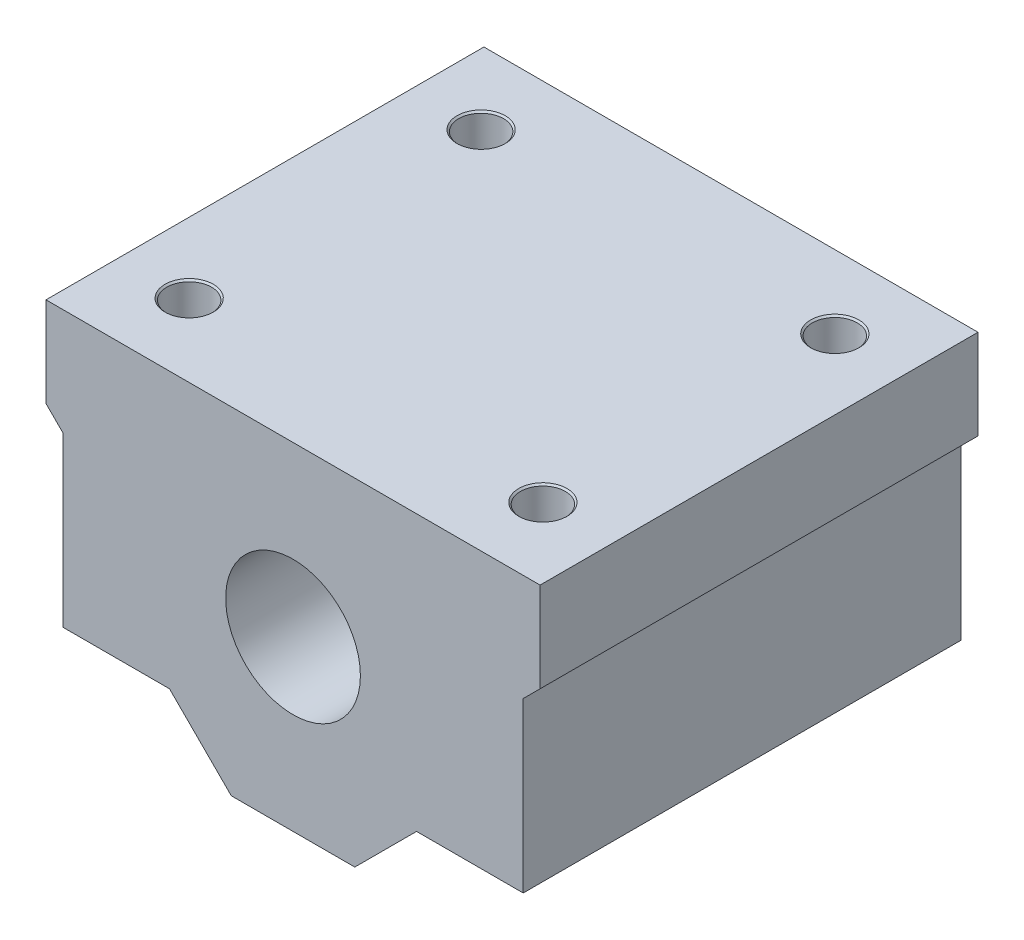
ISO-10303-21;
HEADER;
FILE_DESCRIPTION(('STEP AP214'),'2;1');
FILE_NAME('part.step','',(''),(''),'','','');
FILE_SCHEMA(('AUTOMOTIVE_DESIGN { 1 0 10303 214 1 1 1 1 }'));
ENDSEC;
DATA;
#1=APPLICATION_CONTEXT('core data for automotive mechanical design processes');
#2=APPLICATION_PROTOCOL_DEFINITION('international standard','automotive_design',2000,#1);
#3=PRODUCT_CONTEXT('',#1,'mechanical');
#4=PRODUCT('Part','Part','',(#3));
#5=PRODUCT_RELATED_PRODUCT_CATEGORY('part','',(#4));
#6=PRODUCT_DEFINITION_FORMATION('','',#4);
#7=PRODUCT_DEFINITION_CONTEXT('part definition',#1,'design');
#8=PRODUCT_DEFINITION('design','',#6,#7);
#9=PRODUCT_DEFINITION_SHAPE('','',#8);
#10=(LENGTH_UNIT() NAMED_UNIT(*) SI_UNIT(.MILLI.,.METRE.));
#11=(NAMED_UNIT(*) PLANE_ANGLE_UNIT() SI_UNIT($,.RADIAN.));
#12=(NAMED_UNIT(*) SI_UNIT($,.STERADIAN.) SOLID_ANGLE_UNIT());
#13=UNCERTAINTY_MEASURE_WITH_UNIT(LENGTH_MEASURE(1.E-05),#10,'distance_accuracy_value','');
#14=(GEOMETRIC_REPRESENTATION_CONTEXT(3) GLOBAL_UNCERTAINTY_ASSIGNED_CONTEXT((#13)) GLOBAL_UNIT_ASSIGNED_CONTEXT((#10,
#11,#12)) REPRESENTATION_CONTEXT('',''));
#15=CARTESIAN_POINT('',(0.,0.,0.));
#16=DIRECTION('',(0.,0.,1.));
#17=DIRECTION('',(1.,0.,0.));
#18=AXIS2_PLACEMENT_3D('',#15,#16,#17);
#19=CARTESIAN_POINT('',(0.,0.,39.));
#20=DIRECTION('',(0.,0.,1.));
#21=DIRECTION('',(1.,0.,0.));
#22=AXIS2_PLACEMENT_3D('',#19,#20,#21);
#23=PLANE('',#22);
#24=DIRECTION('',(0.,-1.,0.));
#25=VECTOR('',#24,1.);
#26=CARTESIAN_POINT('',(-22.,15.,39.));
#27=LINE('',#26,#25);
#28=CARTESIAN_POINT('',(-22.,15.,39.));
#29=VERTEX_POINT('',#28);
#30=CARTESIAN_POINT('',(-22.,7.,39.));
#31=VERTEX_POINT('',#30);
#32=EDGE_CURVE('E178',#29,#31,#27,.T.);
#33=ORIENTED_EDGE('',*,*,#32,.T.);
#34=DIRECTION('',(0.707106781186549,-0.707106781186546,0.));
#35=VECTOR('',#34,1.);
#36=CARTESIAN_POINT('',(-22.,7.,39.));
#37=LINE('',#36,#35);
#38=CARTESIAN_POINT('',(-20.5,5.5,39.));
#39=VERTEX_POINT('',#38);
#40=EDGE_CURVE('E106',#31,#39,#37,.T.);
#41=ORIENTED_EDGE('',*,*,#40,.T.);
#42=DIRECTION('',(0.,-1.,0.));
#43=VECTOR('',#42,1.);
#44=CARTESIAN_POINT('',(-20.5,5.5,39.));
#45=LINE('',#44,#43);
#46=CARTESIAN_POINT('',(-20.5,-9.5,39.));
#47=VERTEX_POINT('',#46);
#48=EDGE_CURVE('E338',#39,#47,#45,.T.);
#49=ORIENTED_EDGE('',*,*,#48,.T.);
#50=DIRECTION('',(1.,0.,0.));
#51=VECTOR('',#50,1.);
#52=CARTESIAN_POINT('',(-20.5,-9.5,39.));
#53=LINE('',#52,#51);
#54=CARTESIAN_POINT('',(-11.,-9.5,39.));
#55=VERTEX_POINT('',#54);
#56=EDGE_CURVE('E340',#47,#55,#53,.T.);
#57=ORIENTED_EDGE('',*,*,#56,.T.);
#58=DIRECTION('',(0.707106781186546,-0.707106781186549,0.));
#59=VECTOR('',#58,1.);
#60=CARTESIAN_POINT('',(-11.,-9.5,39.));
#61=LINE('',#60,#59);
#62=CARTESIAN_POINT('',(-5.50000000000002,-15.,39.));
#63=VERTEX_POINT('',#62);
#64=EDGE_CURVE('E342',#55,#63,#61,.T.);
#65=ORIENTED_EDGE('',*,*,#64,.T.);
#66=DIRECTION('',(1.,0.,0.));
#67=VECTOR('',#66,1.);
#68=CARTESIAN_POINT('',(-5.50000000000002,-15.,39.));
#69=LINE('',#68,#67);
#70=CARTESIAN_POINT('',(5.50000000000002,-15.,39.));
#71=VERTEX_POINT('',#70);
#72=EDGE_CURVE('E344',#63,#71,#69,.T.);
#73=ORIENTED_EDGE('',*,*,#72,.T.);
#74=DIRECTION('',(0.707106781186546,0.707106781186549,0.));
#75=VECTOR('',#74,1.);
#76=CARTESIAN_POINT('',(11.,-9.5,39.));
#77=LINE('',#76,#75);
#78=CARTESIAN_POINT('',(11.,-9.5,39.));
#79=VERTEX_POINT('',#78);
#80=EDGE_CURVE('E346',#71,#79,#77,.T.);
#81=ORIENTED_EDGE('',*,*,#80,.T.);
#82=DIRECTION('',(1.,0.,0.));
#83=VECTOR('',#82,1.);
#84=CARTESIAN_POINT('',(20.5,-9.5,39.));
#85=LINE('',#84,#83);
#86=CARTESIAN_POINT('',(20.5,-9.5,39.));
#87=VERTEX_POINT('',#86);
#88=EDGE_CURVE('E348',#79,#87,#85,.T.);
#89=ORIENTED_EDGE('',*,*,#88,.T.);
#90=DIRECTION('',(0.,1.,0.));
#91=VECTOR('',#90,1.);
#92=CARTESIAN_POINT('',(20.5,5.5,39.));
#93=LINE('',#92,#91);
#94=CARTESIAN_POINT('',(20.5,5.5,39.));
#95=VERTEX_POINT('',#94);
#96=EDGE_CURVE('E137',#87,#95,#93,.T.);
#97=ORIENTED_EDGE('',*,*,#96,.T.);
#98=DIRECTION('',(0.707106781186549,0.707106781186546,0.));
#99=VECTOR('',#98,1.);
#100=CARTESIAN_POINT('',(22.,7.,39.));
#101=LINE('',#100,#99);
#102=CARTESIAN_POINT('',(22.,7.,39.));
#103=VERTEX_POINT('',#102);
#104=EDGE_CURVE('E131',#95,#103,#101,.T.);
#105=ORIENTED_EDGE('',*,*,#104,.T.);
#106=DIRECTION('',(0.,1.,0.));
#107=VECTOR('',#106,1.);
#108=CARTESIAN_POINT('',(22.,15.,39.));
#109=LINE('',#108,#107);
#110=CARTESIAN_POINT('',(22.,15.,39.));
#111=VERTEX_POINT('',#110);
#112=EDGE_CURVE('E135',#103,#111,#109,.T.);
#113=ORIENTED_EDGE('',*,*,#112,.T.);
#114=DIRECTION('',(-1.,0.,0.));
#115=VECTOR('',#114,1.);
#116=CARTESIAN_POINT('',(22.,15.,39.));
#117=LINE('',#116,#115);
#118=EDGE_CURVE('E50',#111,#29,#117,.T.);
#119=ORIENTED_EDGE('',*,*,#118,.T.);
#120=EDGE_LOOP('',(#33,#41,#49,#57,#65,#73,#81,#89,#97,#105,#113,#119));
#121=FACE_BOUND('',#120,.T.);
#122=CARTESIAN_POINT('',(0.,0.,39.));
#123=DIRECTION('',(0.,0.,1.));
#124=DIRECTION('',(1.,0.,0.));
#125=AXIS2_PLACEMENT_3D('',#122,#123,#124);
#126=CIRCLE('',#125,6.);
#127=CARTESIAN_POINT('',(6.,0.,39.));
#128=VERTEX_POINT('',#127);
#129=EDGE_CURVE('E159',#128,#128,#126,.T.);
#130=ORIENTED_EDGE('',*,*,#129,.F.);
#131=EDGE_LOOP('',(#130));
#132=FACE_BOUND('',#131,.T.);
#133=ADVANCED_FACE('F33',(#121,#132),#23,.T.);
#134=CARTESIAN_POINT('',(0.,0.,0.));
#135=DIRECTION('',(0.,0.,1.));
#136=DIRECTION('',(1.,0.,0.));
#137=AXIS2_PLACEMENT_3D('',#134,#135,#136);
#138=PLANE('',#137);
#139=CARTESIAN_POINT('',(0.,0.,0.));
#140=DIRECTION('',(0.,0.,1.));
#141=DIRECTION('',(1.,0.,0.));
#142=AXIS2_PLACEMENT_3D('',#139,#140,#141);
#143=CIRCLE('',#142,7.50000000000001);
#144=CARTESIAN_POINT('',(7.50000000000001,0.,0.));
#145=VERTEX_POINT('',#144);
#146=EDGE_CURVE('E42',#145,#145,#143,.T.);
#147=ORIENTED_EDGE('',*,*,#146,.T.);
#148=EDGE_LOOP('',(#147));
#149=FACE_BOUND('',#148,.T.);
#150=DIRECTION('',(0.,-1.,0.));
#151=VECTOR('',#150,1.);
#152=CARTESIAN_POINT('',(-22.,15.,0.));
#153=LINE('',#152,#151);
#154=CARTESIAN_POINT('',(-22.,15.,0.));
#155=VERTEX_POINT('',#154);
#156=CARTESIAN_POINT('',(-22.,7.,0.));
#157=VERTEX_POINT('',#156);
#158=EDGE_CURVE('E155',#155,#157,#153,.T.);
#159=ORIENTED_EDGE('',*,*,#158,.F.);
#160=DIRECTION('',(-1.,0.,0.));
#161=VECTOR('',#160,1.);
#162=CARTESIAN_POINT('',(22.,15.,0.));
#163=LINE('',#162,#161);
#164=CARTESIAN_POINT('',(22.,15.,0.));
#165=VERTEX_POINT('',#164);
#166=EDGE_CURVE('E97',#165,#155,#163,.T.);
#167=ORIENTED_EDGE('',*,*,#166,.F.);
#168=DIRECTION('',(0.,1.,0.));
#169=VECTOR('',#168,1.);
#170=CARTESIAN_POINT('',(22.,15.,0.));
#171=LINE('',#170,#169);
#172=CARTESIAN_POINT('',(22.,7.,0.));
#173=VERTEX_POINT('',#172);
#174=EDGE_CURVE('E91',#173,#165,#171,.T.);
#175=ORIENTED_EDGE('',*,*,#174,.F.);
#176=DIRECTION('',(0.707106781186549,0.707106781186546,0.));
#177=VECTOR('',#176,1.);
#178=CARTESIAN_POINT('',(22.,7.,0.));
#179=LINE('',#178,#177);
#180=CARTESIAN_POINT('',(20.5,5.5,0.));
#181=VERTEX_POINT('',#180);
#182=EDGE_CURVE('E145',#181,#173,#179,.T.);
#183=ORIENTED_EDGE('',*,*,#182,.F.);
#184=DIRECTION('',(0.,1.,0.));
#185=VECTOR('',#184,1.);
#186=CARTESIAN_POINT('',(20.5,5.5,0.));
#187=LINE('',#186,#185);
#188=CARTESIAN_POINT('',(20.5,-9.5,0.));
#189=VERTEX_POINT('',#188);
#190=EDGE_CURVE('E173',#189,#181,#187,.T.);
#191=ORIENTED_EDGE('',*,*,#190,.F.);
#192=DIRECTION('',(1.,0.,0.));
#193=VECTOR('',#192,1.);
#194=CARTESIAN_POINT('',(20.5,-9.5,0.));
#195=LINE('',#194,#193);
#196=CARTESIAN_POINT('',(11.,-9.5,0.));
#197=VERTEX_POINT('',#196);
#198=EDGE_CURVE('E171',#197,#189,#195,.T.);
#199=ORIENTED_EDGE('',*,*,#198,.F.);
#200=DIRECTION('',(0.707106781186546,0.707106781186549,0.));
#201=VECTOR('',#200,1.);
#202=CARTESIAN_POINT('',(11.,-9.5,0.));
#203=LINE('',#202,#201);
#204=CARTESIAN_POINT('',(5.50000000000002,-15.,0.));
#205=VERTEX_POINT('',#204);
#206=EDGE_CURVE('E169',#205,#197,#203,.T.);
#207=ORIENTED_EDGE('',*,*,#206,.F.);
#208=DIRECTION('',(1.,0.,0.));
#209=VECTOR('',#208,1.);
#210=CARTESIAN_POINT('',(-5.50000000000002,-15.,0.));
#211=LINE('',#210,#209);
#212=CARTESIAN_POINT('',(-5.50000000000002,-15.,0.));
#213=VERTEX_POINT('',#212);
#214=EDGE_CURVE('E167',#213,#205,#211,.T.);
#215=ORIENTED_EDGE('',*,*,#214,.F.);
#216=DIRECTION('',(0.707106781186546,-0.707106781186549,0.));
#217=VECTOR('',#216,1.);
#218=CARTESIAN_POINT('',(-11.,-9.5,0.));
#219=LINE('',#218,#217);
#220=CARTESIAN_POINT('',(-11.,-9.5,0.));
#221=VERTEX_POINT('',#220);
#222=EDGE_CURVE('E165',#221,#213,#219,.T.);
#223=ORIENTED_EDGE('',*,*,#222,.F.);
#224=DIRECTION('',(1.,0.,0.));
#225=VECTOR('',#224,1.);
#226=CARTESIAN_POINT('',(-20.5,-9.5,0.));
#227=LINE('',#226,#225);
#228=CARTESIAN_POINT('',(-20.5,-9.5,0.));
#229=VERTEX_POINT('',#228);
#230=EDGE_CURVE('E163',#229,#221,#227,.T.);
#231=ORIENTED_EDGE('',*,*,#230,.F.);
#232=DIRECTION('',(0.,-1.,0.));
#233=VECTOR('',#232,1.);
#234=CARTESIAN_POINT('',(-20.5,5.5,0.));
#235=LINE('',#234,#233);
#236=CARTESIAN_POINT('',(-20.5,5.5,0.));
#237=VERTEX_POINT('',#236);
#238=EDGE_CURVE('E161',#237,#229,#235,.T.);
#239=ORIENTED_EDGE('',*,*,#238,.F.);
#240=DIRECTION('',(0.707106781186549,-0.707106781186546,0.));
#241=VECTOR('',#240,1.);
#242=CARTESIAN_POINT('',(-22.,7.,0.));
#243=LINE('',#242,#241);
#244=EDGE_CURVE('E158',#157,#237,#243,.T.);
#245=ORIENTED_EDGE('',*,*,#244,.F.);
#246=EDGE_LOOP('',(#159,#167,#175,#183,#191,#199,#207,#215,#223,#231,#239,#245));
#247=FACE_BOUND('',#246,.T.);
#248=ADVANCED_FACE('F231',(#149,#247),#138,.F.);
#249=CARTESIAN_POINT('',(-22.,15.,39.));
#250=DIRECTION('',(1.,0.,0.));
#251=DIRECTION('',(0.,0.,-1.));
#252=AXIS2_PLACEMENT_3D('',#249,#250,#251);
#253=PLANE('',#252);
#254=ORIENTED_EDGE('',*,*,#158,.T.);
#255=DIRECTION('',(0.,0.,-1.));
#256=VECTOR('',#255,1.);
#257=CARTESIAN_POINT('',(-22.,7.,39.));
#258=LINE('',#257,#256);
#259=EDGE_CURVE('E203',#31,#157,#258,.T.);
#260=ORIENTED_EDGE('',*,*,#259,.F.);
#261=ORIENTED_EDGE('',*,*,#32,.F.);
#262=DIRECTION('',(0.,0.,-1.));
#263=VECTOR('',#262,1.);
#264=CARTESIAN_POINT('',(-22.,15.,39.));
#265=LINE('',#264,#263);
#266=EDGE_CURVE('E151',#29,#155,#265,.T.);
#267=ORIENTED_EDGE('',*,*,#266,.T.);
#268=EDGE_LOOP('',(#254,#260,#261,#267));
#269=FACE_BOUND('',#268,.T.);
#270=ADVANCED_FACE('F248',(#269),#253,.F.);
#271=CARTESIAN_POINT('',(-22.,7.,39.));
#272=DIRECTION('',(0.707106781186546,0.707106781186549,0.));
#273=DIRECTION('',(-0.707106781186549,0.707106781186546,0.));
#274=AXIS2_PLACEMENT_3D('',#271,#272,#273);
#275=PLANE('',#274);
#276=ORIENTED_EDGE('',*,*,#244,.T.);
#277=DIRECTION('',(0.,0.,-1.));
#278=VECTOR('',#277,1.);
#279=CARTESIAN_POINT('',(-20.5,5.5,39.));
#280=LINE('',#279,#278);
#281=EDGE_CURVE('E200',#39,#237,#280,.T.);
#282=ORIENTED_EDGE('',*,*,#281,.F.);
#283=ORIENTED_EDGE('',*,*,#40,.F.);
#284=ORIENTED_EDGE('',*,*,#259,.T.);
#285=EDGE_LOOP('',(#276,#282,#283,#284));
#286=FACE_BOUND('',#285,.T.);
#287=ADVANCED_FACE('F289',(#286),#275,.F.);
#288=CARTESIAN_POINT('',(-20.5,5.5,39.));
#289=DIRECTION('',(1.,0.,0.));
#290=DIRECTION('',(0.,0.,-1.));
#291=AXIS2_PLACEMENT_3D('',#288,#289,#290);
#292=PLANE('',#291);
#293=ORIENTED_EDGE('',*,*,#238,.T.);
#294=DIRECTION('',(0.,0.,-1.));
#295=VECTOR('',#294,1.);
#296=CARTESIAN_POINT('',(-20.5,-9.5,39.));
#297=LINE('',#296,#295);
#298=EDGE_CURVE('E197',#47,#229,#297,.T.);
#299=ORIENTED_EDGE('',*,*,#298,.F.);
#300=ORIENTED_EDGE('',*,*,#48,.F.);
#301=ORIENTED_EDGE('',*,*,#281,.T.);
#302=EDGE_LOOP('',(#293,#299,#300,#301));
#303=FACE_BOUND('',#302,.T.);
#304=ADVANCED_FACE('F285',(#303),#292,.F.);
#305=CARTESIAN_POINT('',(-20.5,-9.5,39.));
#306=DIRECTION('',(0.,1.,0.));
#307=DIRECTION('',(-1.,0.,0.));
#308=AXIS2_PLACEMENT_3D('',#305,#306,#307);
#309=PLANE('',#308);
#310=CARTESIAN_POINT('',(-15.75,-9.5,32.5));
#311=DIRECTION('',(0.,-1.,0.));
#312=DIRECTION('',(1.,0.,0.));
#313=AXIS2_PLACEMENT_3D('',#310,#311,#312);
#314=CIRCLE('',#313,2.);
#315=CARTESIAN_POINT('',(-13.75,-9.5,32.5));
#316=VERTEX_POINT('',#315);
#317=EDGE_CURVE('E323',#316,#316,#314,.T.);
#318=ORIENTED_EDGE('',*,*,#317,.F.);
#319=EDGE_LOOP('',(#318));
#320=FACE_BOUND('',#319,.T.);
#321=CARTESIAN_POINT('',(-15.75,-9.5,6.5));
#322=DIRECTION('',(0.,-1.,0.));
#323=DIRECTION('',(1.,0.,0.));
#324=AXIS2_PLACEMENT_3D('',#321,#322,#323);
#325=CIRCLE('',#324,2.);
#326=CARTESIAN_POINT('',(-13.75,-9.5,6.5));
#327=VERTEX_POINT('',#326);
#328=EDGE_CURVE('E324',#327,#327,#325,.T.);
#329=ORIENTED_EDGE('',*,*,#328,.F.);
#330=EDGE_LOOP('',(#329));
#331=FACE_BOUND('',#330,.T.);
#332=ORIENTED_EDGE('',*,*,#230,.T.);
#333=DIRECTION('',(0.,0.,-1.));
#334=VECTOR('',#333,1.);
#335=CARTESIAN_POINT('',(-11.,-9.5,39.));
#336=LINE('',#335,#334);
#337=EDGE_CURVE('E194',#55,#221,#336,.T.);
#338=ORIENTED_EDGE('',*,*,#337,.F.);
#339=ORIENTED_EDGE('',*,*,#56,.F.);
#340=ORIENTED_EDGE('',*,*,#298,.T.);
#341=EDGE_LOOP('',(#332,#338,#339,#340));
#342=FACE_BOUND('',#341,.T.);
#343=ADVANCED_FACE('F281',(#320,#331,#342),#309,.F.);
#344=CARTESIAN_POINT('',(-11.,-9.5,39.));
#345=DIRECTION('',(0.707106781186549,0.707106781186546,0.));
#346=DIRECTION('',(-0.707106781186546,0.707106781186549,0.));
#347=AXIS2_PLACEMENT_3D('',#344,#345,#346);
#348=PLANE('',#347);
#349=ORIENTED_EDGE('',*,*,#222,.T.);
#350=DIRECTION('',(0.,0.,-1.));
#351=VECTOR('',#350,1.);
#352=CARTESIAN_POINT('',(-5.50000000000002,-15.,39.));
#353=LINE('',#352,#351);
#354=EDGE_CURVE('E191',#63,#213,#353,.T.);
#355=ORIENTED_EDGE('',*,*,#354,.F.);
#356=ORIENTED_EDGE('',*,*,#64,.F.);
#357=ORIENTED_EDGE('',*,*,#337,.T.);
#358=EDGE_LOOP('',(#349,#355,#356,#357));
#359=FACE_BOUND('',#358,.T.);
#360=ADVANCED_FACE('F277',(#359),#348,.F.);
#361=CARTESIAN_POINT('',(-5.50000000000002,-15.,39.));
#362=DIRECTION('',(0.,1.,0.));
#363=DIRECTION('',(0.,0.,1.));
#364=AXIS2_PLACEMENT_3D('',#361,#362,#363);
#365=PLANE('',#364);
#366=ORIENTED_EDGE('',*,*,#214,.T.);
#367=DIRECTION('',(0.,0.,-1.));
#368=VECTOR('',#367,1.);
#369=CARTESIAN_POINT('',(5.50000000000002,-15.,39.));
#370=LINE('',#369,#368);
#371=EDGE_CURVE('E188',#71,#205,#370,.T.);
#372=ORIENTED_EDGE('',*,*,#371,.F.);
#373=ORIENTED_EDGE('',*,*,#72,.F.);
#374=ORIENTED_EDGE('',*,*,#354,.T.);
#375=EDGE_LOOP('',(#366,#372,#373,#374));
#376=FACE_BOUND('',#375,.T.);
#377=ADVANCED_FACE('F273',(#376),#365,.F.);
#378=CARTESIAN_POINT('',(11.,-9.5,39.));
#379=DIRECTION('',(-0.707106781186549,0.707106781186546,0.));
#380=DIRECTION('',(-0.707106781186546,-0.707106781186549,0.));
#381=AXIS2_PLACEMENT_3D('',#378,#379,#380);
#382=PLANE('',#381);
#383=ORIENTED_EDGE('',*,*,#206,.T.);
#384=DIRECTION('',(0.,0.,-1.));
#385=VECTOR('',#384,1.);
#386=CARTESIAN_POINT('',(11.,-9.5,39.));
#387=LINE('',#386,#385);
#388=EDGE_CURVE('E185',#79,#197,#387,.T.);
#389=ORIENTED_EDGE('',*,*,#388,.F.);
#390=ORIENTED_EDGE('',*,*,#80,.F.);
#391=ORIENTED_EDGE('',*,*,#371,.T.);
#392=EDGE_LOOP('',(#383,#389,#390,#391));
#393=FACE_BOUND('',#392,.T.);
#394=ADVANCED_FACE('F269',(#393),#382,.F.);
#395=CARTESIAN_POINT('',(20.5,-9.5,39.));
#396=DIRECTION('',(0.,1.,0.));
#397=DIRECTION('',(-1.,0.,0.));
#398=AXIS2_PLACEMENT_3D('',#395,#396,#397);
#399=PLANE('',#398);
#400=CARTESIAN_POINT('',(15.75,-9.5,6.5));
#401=DIRECTION('',(0.,-1.,0.));
#402=DIRECTION('',(1.,0.,0.));
#403=AXIS2_PLACEMENT_3D('',#400,#401,#402);
#404=CIRCLE('',#403,2.);
#405=CARTESIAN_POINT('',(17.75,-9.5,6.5));
#406=VERTEX_POINT('',#405);
#407=EDGE_CURVE('E325',#406,#406,#404,.T.);
#408=ORIENTED_EDGE('',*,*,#407,.F.);
#409=EDGE_LOOP('',(#408));
#410=FACE_BOUND('',#409,.T.);
#411=CARTESIAN_POINT('',(15.75,-9.5,32.5));
#412=DIRECTION('',(0.,-1.,0.));
#413=DIRECTION('',(1.,0.,0.));
#414=AXIS2_PLACEMENT_3D('',#411,#412,#413);
#415=CIRCLE('',#414,2.);
#416=CARTESIAN_POINT('',(17.75,-9.5,32.5));
#417=VERTEX_POINT('',#416);
#418=EDGE_CURVE('E330',#417,#417,#415,.T.);
#419=ORIENTED_EDGE('',*,*,#418,.F.);
#420=EDGE_LOOP('',(#419));
#421=FACE_BOUND('',#420,.T.);
#422=ORIENTED_EDGE('',*,*,#198,.T.);
#423=DIRECTION('',(0.,0.,-1.));
#424=VECTOR('',#423,1.);
#425=CARTESIAN_POINT('',(20.5,-9.5,39.));
#426=LINE('',#425,#424);
#427=EDGE_CURVE('E182',#87,#189,#426,.T.);
#428=ORIENTED_EDGE('',*,*,#427,.F.);
#429=ORIENTED_EDGE('',*,*,#88,.F.);
#430=ORIENTED_EDGE('',*,*,#388,.T.);
#431=EDGE_LOOP('',(#422,#428,#429,#430));
#432=FACE_BOUND('',#431,.T.);
#433=ADVANCED_FACE('F265',(#410,#421,#432),#399,.F.);
#434=CARTESIAN_POINT('',(20.5,5.5,39.));
#435=DIRECTION('',(-1.,0.,0.));
#436=DIRECTION('',(0.,0.,1.));
#437=AXIS2_PLACEMENT_3D('',#434,#435,#436);
#438=PLANE('',#437);
#439=ORIENTED_EDGE('',*,*,#190,.T.);
#440=DIRECTION('',(0.,0.,-1.));
#441=VECTOR('',#440,1.);
#442=CARTESIAN_POINT('',(20.5,5.5,39.));
#443=LINE('',#442,#441);
#444=EDGE_CURVE('E146',#95,#181,#443,.T.);
#445=ORIENTED_EDGE('',*,*,#444,.F.);
#446=ORIENTED_EDGE('',*,*,#96,.F.);
#447=ORIENTED_EDGE('',*,*,#427,.T.);
#448=EDGE_LOOP('',(#439,#445,#446,#447));
#449=FACE_BOUND('',#448,.T.);
#450=ADVANCED_FACE('F262',(#449),#438,.F.);
#451=CARTESIAN_POINT('',(22.,7.,39.));
#452=DIRECTION('',(-0.707106781186546,0.707106781186549,0.));
#453=DIRECTION('',(-0.707106781186549,-0.707106781186546,0.));
#454=AXIS2_PLACEMENT_3D('',#451,#452,#453);
#455=PLANE('',#454);
#456=ORIENTED_EDGE('',*,*,#182,.T.);
#457=DIRECTION('',(0.,0.,-1.));
#458=VECTOR('',#457,1.);
#459=CARTESIAN_POINT('',(22.,7.,39.));
#460=LINE('',#459,#458);
#461=EDGE_CURVE('E142',#103,#173,#460,.T.);
#462=ORIENTED_EDGE('',*,*,#461,.F.);
#463=ORIENTED_EDGE('',*,*,#104,.F.);
#464=ORIENTED_EDGE('',*,*,#444,.T.);
#465=EDGE_LOOP('',(#456,#462,#463,#464));
#466=FACE_BOUND('',#465,.T.);
#467=ADVANCED_FACE('F143',(#466),#455,.F.);
#468=CARTESIAN_POINT('',(22.,15.,39.));
#469=DIRECTION('',(-1.,0.,0.));
#470=DIRECTION('',(0.,0.,1.));
#471=AXIS2_PLACEMENT_3D('',#468,#469,#470);
#472=PLANE('',#471);
#473=ORIENTED_EDGE('',*,*,#174,.T.);
#474=DIRECTION('',(0.,0.,-1.));
#475=VECTOR('',#474,1.);
#476=CARTESIAN_POINT('',(22.,15.,39.));
#477=LINE('',#476,#475);
#478=EDGE_CURVE('E147',#111,#165,#477,.T.);
#479=ORIENTED_EDGE('',*,*,#478,.F.);
#480=ORIENTED_EDGE('',*,*,#112,.F.);
#481=ORIENTED_EDGE('',*,*,#461,.T.);
#482=EDGE_LOOP('',(#473,#479,#480,#481));
#483=FACE_BOUND('',#482,.T.);
#484=ADVANCED_FACE('F149',(#483),#472,.F.);
#485=CARTESIAN_POINT('',(22.,15.,39.));
#486=DIRECTION('',(0.,-1.,0.));
#487=DIRECTION('',(0.,0.,-1.));
#488=AXIS2_PLACEMENT_3D('',#485,#486,#487);
#489=PLANE('',#488);
#490=CARTESIAN_POINT('',(15.75,15.,32.5));
#491=DIRECTION('',(0.,-1.,0.));
#492=DIRECTION('',(0.,0.,-1.));
#493=AXIS2_PLACEMENT_3D('',#490,#491,#492);
#494=CIRCLE('',#493,2.15);
#495=CARTESIAN_POINT('',(15.75,15.,30.35));
#496=VERTEX_POINT('',#495);
#497=EDGE_CURVE('E214',#496,#496,#494,.T.);
#498=ORIENTED_EDGE('',*,*,#497,.T.);
#499=EDGE_LOOP('',(#498));
#500=FACE_BOUND('',#499,.T.);
#501=CARTESIAN_POINT('',(15.75,15.,6.5));
#502=DIRECTION('',(0.,-1.,0.));
#503=DIRECTION('',(0.,0.,-1.));
#504=AXIS2_PLACEMENT_3D('',#501,#502,#503);
#505=CIRCLE('',#504,2.15);
#506=CARTESIAN_POINT('',(15.75,15.,4.35));
#507=VERTEX_POINT('',#506);
#508=EDGE_CURVE('E211',#507,#507,#505,.T.);
#509=ORIENTED_EDGE('',*,*,#508,.T.);
#510=EDGE_LOOP('',(#509));
#511=FACE_BOUND('',#510,.T.);
#512=CARTESIAN_POINT('',(-15.75,15.,32.5));
#513=DIRECTION('',(0.,-1.,0.));
#514=DIRECTION('',(0.,0.,-1.));
#515=AXIS2_PLACEMENT_3D('',#512,#513,#514);
#516=CIRCLE('',#515,2.15000000000001);
#517=CARTESIAN_POINT('',(-15.75,15.,30.35));
#518=VERTEX_POINT('',#517);
#519=EDGE_CURVE('E208',#518,#518,#516,.T.);
#520=ORIENTED_EDGE('',*,*,#519,.T.);
#521=EDGE_LOOP('',(#520));
#522=FACE_BOUND('',#521,.T.);
#523=CARTESIAN_POINT('',(-15.75,15.,6.5));
#524=DIRECTION('',(0.,-1.,0.));
#525=DIRECTION('',(0.,0.,-1.));
#526=AXIS2_PLACEMENT_3D('',#523,#524,#525);
#527=CIRCLE('',#526,2.15000000000001);
#528=CARTESIAN_POINT('',(-15.75,15.,4.34999999999999));
#529=VERTEX_POINT('',#528);
#530=EDGE_CURVE('E205',#529,#529,#527,.T.);
#531=ORIENTED_EDGE('',*,*,#530,.T.);
#532=EDGE_LOOP('',(#531));
#533=FACE_BOUND('',#532,.T.);
#534=ORIENTED_EDGE('',*,*,#166,.T.);
#535=ORIENTED_EDGE('',*,*,#266,.F.);
#536=ORIENTED_EDGE('',*,*,#118,.F.);
#537=ORIENTED_EDGE('',*,*,#478,.T.);
#538=EDGE_LOOP('',(#534,#535,#536,#537));
#539=FACE_BOUND('',#538,.T.);
#540=ADVANCED_FACE('F254',(#500,#511,#522,#533,#539),#489,.F.);
#541=CARTESIAN_POINT('',(0.,0.,39.));
#542=DIRECTION('',(0.,0.,-1.));
#543=DIRECTION('',(-1.,0.,0.));
#544=AXIS2_PLACEMENT_3D('',#541,#542,#543);
#545=CYLINDRICAL_SURFACE('',#544,6.);
#546=CARTESIAN_POINT('',(0.,0.,1.50000000000002));
#547=DIRECTION('',(0.,0.,1.));
#548=DIRECTION('',(1.,0.,0.));
#549=AXIS2_PLACEMENT_3D('',#546,#547,#548);
#550=CIRCLE('',#549,6.);
#551=CARTESIAN_POINT('',(6.,0.,1.50000000000002));
#552=VERTEX_POINT('',#551);
#553=EDGE_CURVE('E11',#552,#552,#550,.F.);
#554=ORIENTED_EDGE('',*,*,#553,.T.);
#555=EDGE_LOOP('',(#554));
#556=FACE_BOUND('',#555,.T.);
#557=ORIENTED_EDGE('',*,*,#129,.T.);
#558=EDGE_LOOP('',(#557));
#559=FACE_BOUND('',#558,.T.);
#560=ADVANCED_FACE('F251',(#556,#559),#545,.F.);
#561=CARTESIAN_POINT('',(-15.75,29.5,6.5));
#562=DIRECTION('',(0.,-1.,0.));
#563=DIRECTION('',(1.,0.,0.));
#564=AXIS2_PLACEMENT_3D('',#561,#562,#563);
#565=CYLINDRICAL_SURFACE('',#564,2.);
#566=CARTESIAN_POINT('',(-15.75,14.85,6.5));
#567=DIRECTION('',(0.,-1.,0.));
#568=DIRECTION('',(0.,0.,-1.));
#569=AXIS2_PLACEMENT_3D('',#566,#567,#568);
#570=CIRCLE('',#569,2.);
#571=CARTESIAN_POINT('',(-15.75,14.85,4.5));
#572=VERTEX_POINT('',#571);
#573=EDGE_CURVE('E226',#572,#572,#570,.F.);
#574=ORIENTED_EDGE('',*,*,#573,.T.);
#575=EDGE_LOOP('',(#574));
#576=FACE_BOUND('',#575,.T.);
#577=ORIENTED_EDGE('',*,*,#328,.T.);
#578=EDGE_LOOP('',(#577));
#579=FACE_BOUND('',#578,.T.);
#580=ADVANCED_FACE('F376',(#576,#579),#565,.F.);
#581=CARTESIAN_POINT('',(15.75,29.5,32.5));
#582=DIRECTION('',(0.,-1.,0.));
#583=DIRECTION('',(1.,0.,0.));
#584=AXIS2_PLACEMENT_3D('',#581,#582,#583);
#585=CYLINDRICAL_SURFACE('',#584,2.);
#586=CARTESIAN_POINT('',(15.75,14.85,32.5));
#587=DIRECTION('',(0.,-1.,0.));
#588=DIRECTION('',(0.,0.,-1.));
#589=AXIS2_PLACEMENT_3D('',#586,#587,#588);
#590=CIRCLE('',#589,2.);
#591=CARTESIAN_POINT('',(15.75,14.85,30.5));
#592=VERTEX_POINT('',#591);
#593=EDGE_CURVE('E217',#592,#592,#590,.F.);
#594=ORIENTED_EDGE('',*,*,#593,.T.);
#595=EDGE_LOOP('',(#594));
#596=FACE_BOUND('',#595,.T.);
#597=ORIENTED_EDGE('',*,*,#418,.T.);
#598=EDGE_LOOP('',(#597));
#599=FACE_BOUND('',#598,.T.);
#600=ADVANCED_FACE('F381',(#596,#599),#585,.F.);
#601=CARTESIAN_POINT('',(15.75,29.5,6.5));
#602=DIRECTION('',(0.,-1.,0.));
#603=DIRECTION('',(1.,0.,0.));
#604=AXIS2_PLACEMENT_3D('',#601,#602,#603);
#605=CYLINDRICAL_SURFACE('',#604,2.);
#606=CARTESIAN_POINT('',(15.75,14.85,6.5));
#607=DIRECTION('',(0.,-1.,0.));
#608=DIRECTION('',(0.,0.,-1.));
#609=AXIS2_PLACEMENT_3D('',#606,#607,#608);
#610=CIRCLE('',#609,2.);
#611=CARTESIAN_POINT('',(15.75,14.85,4.5));
#612=VERTEX_POINT('',#611);
#613=EDGE_CURVE('E220',#612,#612,#610,.F.);
#614=ORIENTED_EDGE('',*,*,#613,.T.);
#615=EDGE_LOOP('',(#614));
#616=FACE_BOUND('',#615,.T.);
#617=ORIENTED_EDGE('',*,*,#407,.T.);
#618=EDGE_LOOP('',(#617));
#619=FACE_BOUND('',#618,.T.);
#620=ADVANCED_FACE('F319',(#616,#619),#605,.F.);
#621=CARTESIAN_POINT('',(-15.75,29.5,32.5));
#622=DIRECTION('',(0.,-1.,0.));
#623=DIRECTION('',(1.,0.,0.));
#624=AXIS2_PLACEMENT_3D('',#621,#622,#623);
#625=CYLINDRICAL_SURFACE('',#624,2.);
#626=CARTESIAN_POINT('',(-15.75,14.85,32.5));
#627=DIRECTION('',(0.,-1.,0.));
#628=DIRECTION('',(0.,0.,-1.));
#629=AXIS2_PLACEMENT_3D('',#626,#627,#628);
#630=CIRCLE('',#629,2.);
#631=CARTESIAN_POINT('',(-15.75,14.85,30.5));
#632=VERTEX_POINT('',#631);
#633=EDGE_CURVE('E223',#632,#632,#630,.F.);
#634=ORIENTED_EDGE('',*,*,#633,.T.);
#635=EDGE_LOOP('',(#634));
#636=FACE_BOUND('',#635,.T.);
#637=ORIENTED_EDGE('',*,*,#317,.T.);
#638=EDGE_LOOP('',(#637));
#639=FACE_BOUND('',#638,.T.);
#640=ADVANCED_FACE('F300',(#636,#639),#625,.F.);
#641=CARTESIAN_POINT('',(15.75,15.,32.5));
#642=DIRECTION('',(0.,1.,0.));
#643=DIRECTION('',(0.,0.,1.));
#644=AXIS2_PLACEMENT_3D('',#641,#642,#643);
#645=CONICAL_SURFACE('',#644,2.15,0.785398163397448);
#646=ORIENTED_EDGE('',*,*,#593,.F.);
#647=EDGE_LOOP('',(#646));
#648=FACE_BOUND('',#647,.T.);
#649=ORIENTED_EDGE('',*,*,#497,.F.);
#650=EDGE_LOOP('',(#649));
#651=FACE_BOUND('',#650,.T.);
#652=ADVANCED_FACE('F296',(#648,#651),#645,.F.);
#653=CARTESIAN_POINT('',(15.75,15.,6.5));
#654=DIRECTION('',(0.,1.,0.));
#655=DIRECTION('',(0.,0.,1.));
#656=AXIS2_PLACEMENT_3D('',#653,#654,#655);
#657=CONICAL_SURFACE('',#656,2.15,0.785398163397447);
#658=ORIENTED_EDGE('',*,*,#613,.F.);
#659=EDGE_LOOP('',(#658));
#660=FACE_BOUND('',#659,.T.);
#661=ORIENTED_EDGE('',*,*,#508,.F.);
#662=EDGE_LOOP('',(#661));
#663=FACE_BOUND('',#662,.T.);
#664=ADVANCED_FACE('F299',(#660,#663),#657,.F.);
#665=CARTESIAN_POINT('',(-15.75,15.,32.5));
#666=DIRECTION('',(0.,1.,0.));
#667=DIRECTION('',(0.,0.,1.));
#668=AXIS2_PLACEMENT_3D('',#665,#666,#667);
#669=CONICAL_SURFACE('',#668,2.15000000000001,0.785398163397448);
#670=ORIENTED_EDGE('',*,*,#633,.F.);
#671=EDGE_LOOP('',(#670));
#672=FACE_BOUND('',#671,.T.);
#673=ORIENTED_EDGE('',*,*,#519,.F.);
#674=EDGE_LOOP('',(#673));
#675=FACE_BOUND('',#674,.T.);
#676=ADVANCED_FACE('F240',(#672,#675),#669,.F.);
#677=CARTESIAN_POINT('',(-15.75,15.,6.5));
#678=DIRECTION('',(0.,1.,0.));
#679=DIRECTION('',(0.,0.,1.));
#680=AXIS2_PLACEMENT_3D('',#677,#678,#679);
#681=CONICAL_SURFACE('',#680,2.15000000000001,0.785398163397424);
#682=ORIENTED_EDGE('',*,*,#573,.F.);
#683=EDGE_LOOP('',(#682));
#684=FACE_BOUND('',#683,.T.);
#685=ORIENTED_EDGE('',*,*,#530,.F.);
#686=EDGE_LOOP('',(#685));
#687=FACE_BOUND('',#686,.T.);
#688=ADVANCED_FACE('F235',(#684,#687),#681,.F.);
#689=CARTESIAN_POINT('',(0.,0.,0.));
#690=DIRECTION('',(0.,0.,-1.));
#691=DIRECTION('',(-1.,0.,0.));
#692=AXIS2_PLACEMENT_3D('',#689,#690,#691);
#693=CONICAL_SURFACE('',#692,7.50000000000001,0.785398163397445);
#694=ORIENTED_EDGE('',*,*,#553,.F.);
#695=EDGE_LOOP('',(#694));
#696=FACE_BOUND('',#695,.T.);
#697=ORIENTED_EDGE('',*,*,#146,.F.);
#698=EDGE_LOOP('',(#697));
#699=FACE_BOUND('',#698,.T.);
#700=ADVANCED_FACE('F35',(#696,#699),#693,.F.);
#701=CLOSED_SHELL('',(#133,#248,#270,#287,#304,#343,#360,#377,#394,#433,#450,#467,#484,#540,
#560,#580,#600,#620,#640,#652,#664,#676,#688,#700));
#702=MANIFOLD_SOLID_BREP('B2',#701);
#703=ADVANCED_BREP_SHAPE_REPRESENTATION('',(#18,#702),#14);
#704=SHAPE_DEFINITION_REPRESENTATION(#9,#703);
ENDSEC;
END-ISO-10303-21;
